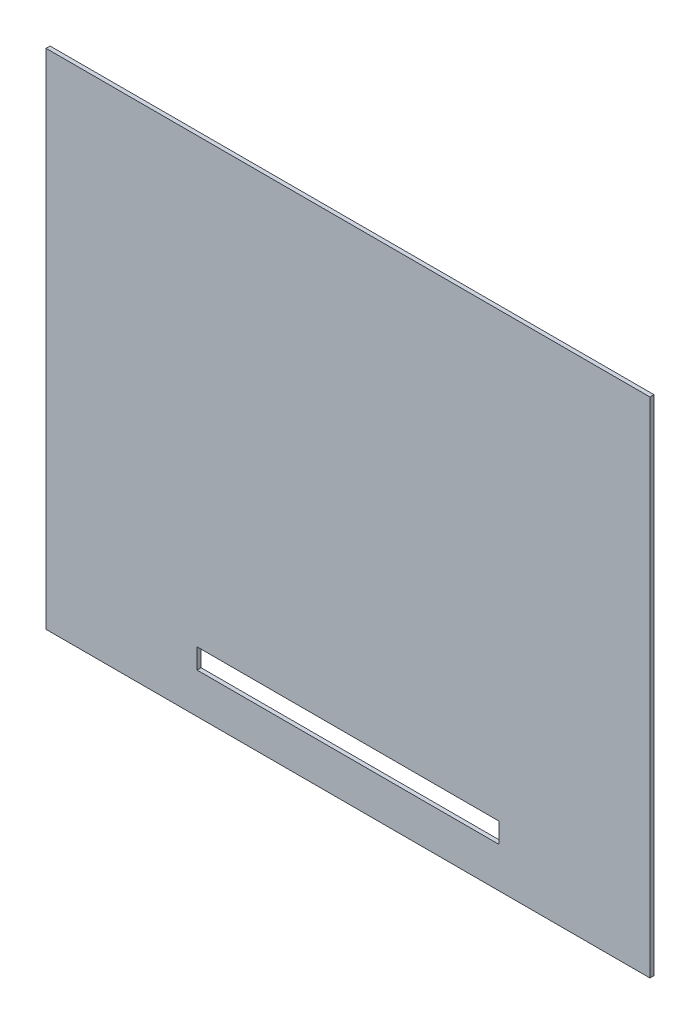
ISO-10303-21;
HEADER;
FILE_DESCRIPTION(('STEP AP214'),'2;1');
FILE_NAME('part.step','',(''),(''),'','','');
FILE_SCHEMA(('AUTOMOTIVE_DESIGN { 1 0 10303 214 1 1 1 1 }'));
ENDSEC;
DATA;
#1=APPLICATION_CONTEXT('core data for automotive mechanical design processes');
#2=APPLICATION_PROTOCOL_DEFINITION('international standard','automotive_design',2000,#1);
#3=PRODUCT_CONTEXT('',#1,'mechanical');
#4=PRODUCT('Part','Part','',(#3));
#5=PRODUCT_RELATED_PRODUCT_CATEGORY('part','',(#4));
#6=PRODUCT_DEFINITION_FORMATION('','',#4);
#7=PRODUCT_DEFINITION_CONTEXT('part definition',#1,'design');
#8=PRODUCT_DEFINITION('design','',#6,#7);
#9=PRODUCT_DEFINITION_SHAPE('','',#8);
#10=(LENGTH_UNIT() NAMED_UNIT(*) SI_UNIT(.MILLI.,.METRE.));
#11=(NAMED_UNIT(*) PLANE_ANGLE_UNIT() SI_UNIT($,.RADIAN.));
#12=(NAMED_UNIT(*) SI_UNIT($,.STERADIAN.) SOLID_ANGLE_UNIT());
#13=UNCERTAINTY_MEASURE_WITH_UNIT(LENGTH_MEASURE(1.E-05),#10,'distance_accuracy_value','');
#14=(GEOMETRIC_REPRESENTATION_CONTEXT(3) GLOBAL_UNCERTAINTY_ASSIGNED_CONTEXT((#13)) GLOBAL_UNIT_ASSIGNED_CONTEXT((#10,
#11,#12)) REPRESENTATION_CONTEXT('',''));
#15=CARTESIAN_POINT('',(0.,0.,0.));
#16=DIRECTION('',(0.,0.,1.));
#17=DIRECTION('',(1.,0.,0.));
#18=AXIS2_PLACEMENT_3D('',#15,#16,#17);
#19=CARTESIAN_POINT('',(-150.,125.,2.));
#20=DIRECTION('',(1.,0.,0.));
#21=DIRECTION('',(0.,0.,-1.));
#22=AXIS2_PLACEMENT_3D('',#19,#20,#21);
#23=PLANE('',#22);
#24=DIRECTION('',(0.,-1.,0.));
#25=VECTOR('',#24,1.);
#26=CARTESIAN_POINT('',(-150.,125.,0.));
#27=LINE('',#26,#25);
#28=CARTESIAN_POINT('',(-150.,125.,0.));
#29=VERTEX_POINT('',#28);
#30=CARTESIAN_POINT('',(-150.,-125.,0.));
#31=VERTEX_POINT('',#30);
#32=EDGE_CURVE('E130',#29,#31,#27,.T.);
#33=ORIENTED_EDGE('',*,*,#32,.T.);
#34=DIRECTION('',(0.,0.,-1.));
#35=VECTOR('',#34,1.);
#36=CARTESIAN_POINT('',(-150.,-125.,2.));
#37=LINE('',#36,#35);
#38=CARTESIAN_POINT('',(-150.,-125.,2.));
#39=VERTEX_POINT('',#38);
#40=EDGE_CURVE('E11',#39,#31,#37,.T.);
#41=ORIENTED_EDGE('',*,*,#40,.F.);
#42=DIRECTION('',(0.,-1.,0.));
#43=VECTOR('',#42,1.);
#44=CARTESIAN_POINT('',(-150.,125.,2.));
#45=LINE('',#44,#43);
#46=CARTESIAN_POINT('',(-150.,125.,2.));
#47=VERTEX_POINT('',#46);
#48=EDGE_CURVE('E134',#47,#39,#45,.T.);
#49=ORIENTED_EDGE('',*,*,#48,.F.);
#50=DIRECTION('',(0.,0.,-1.));
#51=VECTOR('',#50,1.);
#52=CARTESIAN_POINT('',(-150.,125.,2.));
#53=LINE('',#52,#51);
#54=EDGE_CURVE('E144',#47,#29,#53,.T.);
#55=ORIENTED_EDGE('',*,*,#54,.T.);
#56=EDGE_LOOP('',(#33,#41,#49,#55));
#57=FACE_BOUND('',#56,.T.);
#58=ADVANCED_FACE('F33',(#57),#23,.F.);
#59=CARTESIAN_POINT('',(-150.,-125.,2.));
#60=DIRECTION('',(0.,1.,0.));
#61=DIRECTION('',(0.,0.,1.));
#62=AXIS2_PLACEMENT_3D('',#59,#60,#61);
#63=PLANE('',#62);
#64=DIRECTION('',(1.,0.,0.));
#65=VECTOR('',#64,1.);
#66=CARTESIAN_POINT('',(-150.,-125.,0.));
#67=LINE('',#66,#65);
#68=CARTESIAN_POINT('',(150.,-125.,0.));
#69=VERTEX_POINT('',#68);
#70=EDGE_CURVE('E147',#31,#69,#67,.T.);
#71=ORIENTED_EDGE('',*,*,#70,.T.);
#72=DIRECTION('',(0.,0.,-1.));
#73=VECTOR('',#72,1.);
#74=CARTESIAN_POINT('',(150.,-125.,2.));
#75=LINE('',#74,#73);
#76=CARTESIAN_POINT('',(150.,-125.,2.));
#77=VERTEX_POINT('',#76);
#78=EDGE_CURVE('E40',#77,#69,#75,.T.);
#79=ORIENTED_EDGE('',*,*,#78,.F.);
#80=DIRECTION('',(1.,0.,0.));
#81=VECTOR('',#80,1.);
#82=CARTESIAN_POINT('',(-150.,-125.,2.));
#83=LINE('',#82,#81);
#84=EDGE_CURVE('E137',#39,#77,#83,.T.);
#85=ORIENTED_EDGE('',*,*,#84,.F.);
#86=ORIENTED_EDGE('',*,*,#40,.T.);
#87=EDGE_LOOP('',(#71,#79,#85,#86));
#88=FACE_BOUND('',#87,.T.);
#89=ADVANCED_FACE('F175',(#88),#63,.F.);
#90=CARTESIAN_POINT('',(150.,125.,2.));
#91=DIRECTION('',(-1.,0.,0.));
#92=DIRECTION('',(0.,0.,1.));
#93=AXIS2_PLACEMENT_3D('',#90,#91,#92);
#94=PLANE('',#93);
#95=DIRECTION('',(0.,1.,0.));
#96=VECTOR('',#95,1.);
#97=CARTESIAN_POINT('',(150.,125.,0.));
#98=LINE('',#97,#96);
#99=CARTESIAN_POINT('',(150.,125.,0.));
#100=VERTEX_POINT('',#99);
#101=EDGE_CURVE('E149',#69,#100,#98,.T.);
#102=ORIENTED_EDGE('',*,*,#101,.T.);
#103=DIRECTION('',(0.,0.,-1.));
#104=VECTOR('',#103,1.);
#105=CARTESIAN_POINT('',(150.,125.,2.));
#106=LINE('',#105,#104);
#107=CARTESIAN_POINT('',(150.,125.,2.));
#108=VERTEX_POINT('',#107);
#109=EDGE_CURVE('E154',#108,#100,#106,.T.);
#110=ORIENTED_EDGE('',*,*,#109,.F.);
#111=DIRECTION('',(0.,1.,0.));
#112=VECTOR('',#111,1.);
#113=CARTESIAN_POINT('',(150.,125.,2.));
#114=LINE('',#113,#112);
#115=EDGE_CURVE('E140',#77,#108,#114,.T.);
#116=ORIENTED_EDGE('',*,*,#115,.F.);
#117=ORIENTED_EDGE('',*,*,#78,.T.);
#118=EDGE_LOOP('',(#102,#110,#116,#117));
#119=FACE_BOUND('',#118,.T.);
#120=ADVANCED_FACE('F161',(#119),#94,.F.);
#121=CARTESIAN_POINT('',(-150.,125.,2.));
#122=DIRECTION('',(0.,-1.,0.));
#123=DIRECTION('',(0.,0.,-1.));
#124=AXIS2_PLACEMENT_3D('',#121,#122,#123);
#125=PLANE('',#124);
#126=DIRECTION('',(-1.,0.,0.));
#127=VECTOR('',#126,1.);
#128=CARTESIAN_POINT('',(-150.,125.,0.));
#129=LINE('',#128,#127);
#130=EDGE_CURVE('E138',#100,#29,#129,.T.);
#131=ORIENTED_EDGE('',*,*,#130,.T.);
#132=ORIENTED_EDGE('',*,*,#54,.F.);
#133=DIRECTION('',(-1.,0.,0.));
#134=VECTOR('',#133,1.);
#135=CARTESIAN_POINT('',(-150.,125.,2.));
#136=LINE('',#135,#134);
#137=EDGE_CURVE('E142',#108,#47,#136,.T.);
#138=ORIENTED_EDGE('',*,*,#137,.F.);
#139=ORIENTED_EDGE('',*,*,#109,.T.);
#140=EDGE_LOOP('',(#131,#132,#138,#139));
#141=FACE_BOUND('',#140,.T.);
#142=ADVANCED_FACE('F170',(#141),#125,.F.);
#143=CARTESIAN_POINT('',(0.,0.,2.));
#144=DIRECTION('',(0.,0.,1.));
#145=DIRECTION('',(1.,0.,0.));
#146=AXIS2_PLACEMENT_3D('',#143,#144,#145);
#147=PLANE('',#146);
#148=DIRECTION('',(0.,1.,0.));
#149=VECTOR('',#148,1.);
#150=CARTESIAN_POINT('',(-75.,-95.,2.));
#151=LINE('',#150,#149);
#152=CARTESIAN_POINT('',(-75.,-105.,2.));
#153=VERTEX_POINT('',#152);
#154=CARTESIAN_POINT('',(-75.,-95.,2.));
#155=VERTEX_POINT('',#154);
#156=EDGE_CURVE('E99',#153,#155,#151,.T.);
#157=ORIENTED_EDGE('',*,*,#156,.T.);
#158=DIRECTION('',(1.,0.,0.));
#159=VECTOR('',#158,1.);
#160=CARTESIAN_POINT('',(75.,-95.,2.));
#161=LINE('',#160,#159);
#162=CARTESIAN_POINT('',(75.,-95.,2.));
#163=VERTEX_POINT('',#162);
#164=EDGE_CURVE('E108',#155,#163,#161,.T.);
#165=ORIENTED_EDGE('',*,*,#164,.T.);
#166=DIRECTION('',(0.,-1.,0.));
#167=VECTOR('',#166,1.);
#168=CARTESIAN_POINT('',(75.,-95.,2.));
#169=LINE('',#168,#167);
#170=CARTESIAN_POINT('',(75.,-105.,2.));
#171=VERTEX_POINT('',#170);
#172=EDGE_CURVE('E47',#163,#171,#169,.T.);
#173=ORIENTED_EDGE('',*,*,#172,.T.);
#174=DIRECTION('',(-1.,0.,0.));
#175=VECTOR('',#174,1.);
#176=CARTESIAN_POINT('',(75.,-105.,2.));
#177=LINE('',#176,#175);
#178=EDGE_CURVE('E105',#171,#153,#177,.T.);
#179=ORIENTED_EDGE('',*,*,#178,.T.);
#180=EDGE_LOOP('',(#157,#165,#173,#179));
#181=FACE_BOUND('',#180,.T.);
#182=ORIENTED_EDGE('',*,*,#48,.T.);
#183=ORIENTED_EDGE('',*,*,#84,.T.);
#184=ORIENTED_EDGE('',*,*,#115,.T.);
#185=ORIENTED_EDGE('',*,*,#137,.T.);
#186=EDGE_LOOP('',(#182,#183,#184,#185));
#187=FACE_BOUND('',#186,.T.);
#188=ADVANCED_FACE('F112',(#181,#187),#147,.T.);
#189=CARTESIAN_POINT('',(0.,0.,0.));
#190=DIRECTION('',(0.,0.,1.));
#191=DIRECTION('',(1.,0.,0.));
#192=AXIS2_PLACEMENT_3D('',#189,#190,#191);
#193=PLANE('',#192);
#194=DIRECTION('',(1.,0.,0.));
#195=VECTOR('',#194,1.);
#196=CARTESIAN_POINT('',(75.,-95.,0.));
#197=LINE('',#196,#195);
#198=CARTESIAN_POINT('',(-75.,-95.,0.));
#199=VERTEX_POINT('',#198);
#200=CARTESIAN_POINT('',(75.,-95.,0.));
#201=VERTEX_POINT('',#200);
#202=EDGE_CURVE('E124',#199,#201,#197,.T.);
#203=ORIENTED_EDGE('',*,*,#202,.F.);
#204=DIRECTION('',(0.,1.,0.));
#205=VECTOR('',#204,1.);
#206=CARTESIAN_POINT('',(-75.,-95.,0.));
#207=LINE('',#206,#205);
#208=CARTESIAN_POINT('',(-75.,-105.,0.));
#209=VERTEX_POINT('',#208);
#210=EDGE_CURVE('E55',#209,#199,#207,.T.);
#211=ORIENTED_EDGE('',*,*,#210,.F.);
#212=DIRECTION('',(-1.,0.,0.));
#213=VECTOR('',#212,1.);
#214=CARTESIAN_POINT('',(75.,-105.,0.));
#215=LINE('',#214,#213);
#216=CARTESIAN_POINT('',(75.,-105.,0.));
#217=VERTEX_POINT('',#216);
#218=EDGE_CURVE('E115',#217,#209,#215,.T.);
#219=ORIENTED_EDGE('',*,*,#218,.F.);
#220=DIRECTION('',(0.,-1.,0.));
#221=VECTOR('',#220,1.);
#222=CARTESIAN_POINT('',(75.,-95.,0.));
#223=LINE('',#222,#221);
#224=EDGE_CURVE('E118',#201,#217,#223,.T.);
#225=ORIENTED_EDGE('',*,*,#224,.F.);
#226=EDGE_LOOP('',(#203,#211,#219,#225));
#227=FACE_BOUND('',#226,.T.);
#228=ORIENTED_EDGE('',*,*,#32,.F.);
#229=ORIENTED_EDGE('',*,*,#130,.F.);
#230=ORIENTED_EDGE('',*,*,#101,.F.);
#231=ORIENTED_EDGE('',*,*,#70,.F.);
#232=EDGE_LOOP('',(#228,#229,#230,#231));
#233=FACE_BOUND('',#232,.T.);
#234=ADVANCED_FACE('F167',(#227,#233),#193,.F.);
#235=CARTESIAN_POINT('',(-75.,-95.,2.));
#236=DIRECTION('',(-1.,0.,0.));
#237=DIRECTION('',(0.,-1.,0.));
#238=AXIS2_PLACEMENT_3D('',#235,#236,#237);
#239=PLANE('',#238);
#240=ORIENTED_EDGE('',*,*,#210,.T.);
#241=DIRECTION('',(0.,0.,-1.));
#242=VECTOR('',#241,1.);
#243=CARTESIAN_POINT('',(-75.,-95.,2.));
#244=LINE('',#243,#242);
#245=EDGE_CURVE('E95',#155,#199,#244,.T.);
#246=ORIENTED_EDGE('',*,*,#245,.F.);
#247=ORIENTED_EDGE('',*,*,#156,.F.);
#248=DIRECTION('',(0.,0.,-1.));
#249=VECTOR('',#248,1.);
#250=CARTESIAN_POINT('',(-75.,-105.,2.));
#251=LINE('',#250,#249);
#252=EDGE_CURVE('E128',#153,#209,#251,.T.);
#253=ORIENTED_EDGE('',*,*,#252,.T.);
#254=EDGE_LOOP('',(#240,#246,#247,#253));
#255=FACE_BOUND('',#254,.T.);
#256=ADVANCED_FACE('F97',(#255),#239,.F.);
#257=CARTESIAN_POINT('',(75.,-105.,2.));
#258=DIRECTION('',(0.,-1.,0.));
#259=DIRECTION('',(0.,0.,-1.));
#260=AXIS2_PLACEMENT_3D('',#257,#258,#259);
#261=PLANE('',#260);
#262=ORIENTED_EDGE('',*,*,#218,.T.);
#263=ORIENTED_EDGE('',*,*,#252,.F.);
#264=ORIENTED_EDGE('',*,*,#178,.F.);
#265=DIRECTION('',(0.,0.,-1.));
#266=VECTOR('',#265,1.);
#267=CARTESIAN_POINT('',(75.,-105.,2.));
#268=LINE('',#267,#266);
#269=EDGE_CURVE('E131',#171,#217,#268,.T.);
#270=ORIENTED_EDGE('',*,*,#269,.T.);
#271=EDGE_LOOP('',(#262,#263,#264,#270));
#272=FACE_BOUND('',#271,.T.);
#273=ADVANCED_FACE('F192',(#272),#261,.F.);
#274=CARTESIAN_POINT('',(75.,-95.,2.));
#275=DIRECTION('',(1.,0.,0.));
#276=DIRECTION('',(0.,1.,0.));
#277=AXIS2_PLACEMENT_3D('',#274,#275,#276);
#278=PLANE('',#277);
#279=ORIENTED_EDGE('',*,*,#224,.T.);
#280=ORIENTED_EDGE('',*,*,#269,.F.);
#281=ORIENTED_EDGE('',*,*,#172,.F.);
#282=DIRECTION('',(0.,0.,-1.));
#283=VECTOR('',#282,1.);
#284=CARTESIAN_POINT('',(75.,-95.,2.));
#285=LINE('',#284,#283);
#286=EDGE_CURVE('E104',#163,#201,#285,.T.);
#287=ORIENTED_EDGE('',*,*,#286,.T.);
#288=EDGE_LOOP('',(#279,#280,#281,#287));
#289=FACE_BOUND('',#288,.T.);
#290=ADVANCED_FACE('F195',(#289),#278,.F.);
#291=CARTESIAN_POINT('',(75.,-95.,2.));
#292=DIRECTION('',(0.,1.,0.));
#293=DIRECTION('',(0.,0.,1.));
#294=AXIS2_PLACEMENT_3D('',#291,#292,#293);
#295=PLANE('',#294);
#296=ORIENTED_EDGE('',*,*,#202,.T.);
#297=ORIENTED_EDGE('',*,*,#286,.F.);
#298=ORIENTED_EDGE('',*,*,#164,.F.);
#299=ORIENTED_EDGE('',*,*,#245,.T.);
#300=EDGE_LOOP('',(#296,#297,#298,#299));
#301=FACE_BOUND('',#300,.T.);
#302=ADVANCED_FACE('F109',(#301),#295,.F.);
#303=CLOSED_SHELL('',(#58,#89,#120,#142,#188,#234,#256,#273,#290,#302));
#304=MANIFOLD_SOLID_BREP('B2',#303);
#305=ADVANCED_BREP_SHAPE_REPRESENTATION('',(#18,#304),#14);
#306=SHAPE_DEFINITION_REPRESENTATION(#9,#305);
ENDSEC;
END-ISO-10303-21;
